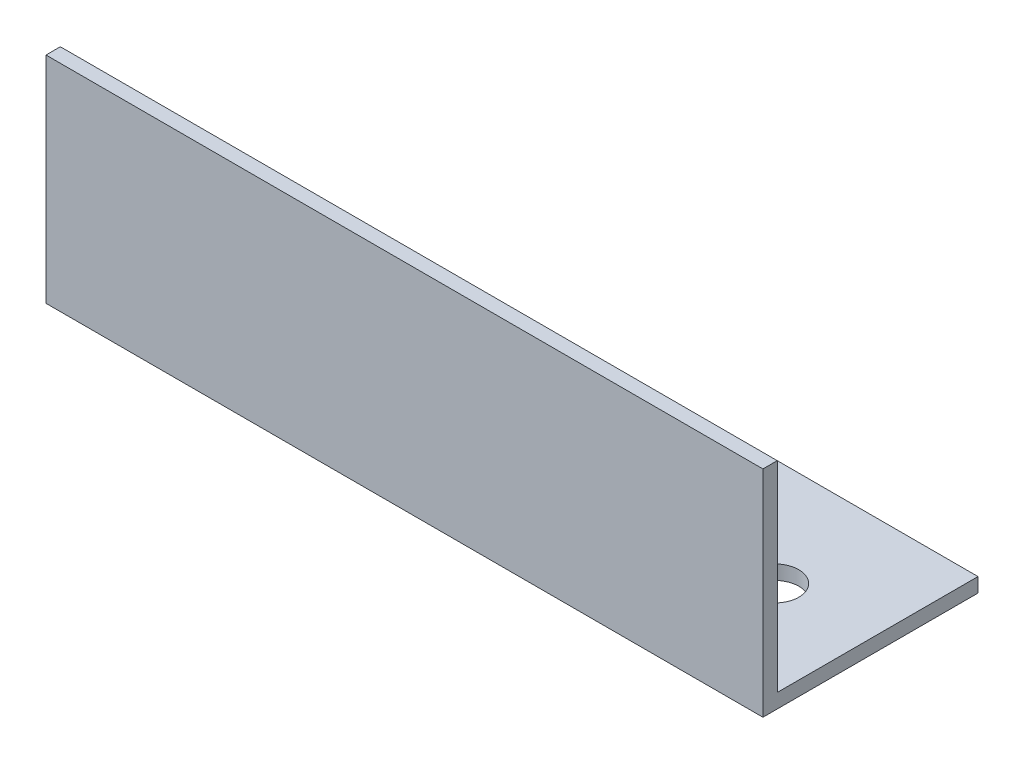
ISO-10303-21;
HEADER;
FILE_DESCRIPTION(('STEP AP214'),'2;1');
FILE_NAME('part.step','',(''),(''),'','','');
FILE_SCHEMA(('AUTOMOTIVE_DESIGN { 1 0 10303 214 1 1 1 1 }'));
ENDSEC;
DATA;
#1=APPLICATION_CONTEXT('core data for automotive mechanical design processes');
#2=APPLICATION_PROTOCOL_DEFINITION('international standard','automotive_design',2000,#1);
#3=PRODUCT_CONTEXT('',#1,'mechanical');
#4=PRODUCT('Part','Part','',(#3));
#5=PRODUCT_RELATED_PRODUCT_CATEGORY('part','',(#4));
#6=PRODUCT_DEFINITION_FORMATION('','',#4);
#7=PRODUCT_DEFINITION_CONTEXT('part definition',#1,'design');
#8=PRODUCT_DEFINITION('design','',#6,#7);
#9=PRODUCT_DEFINITION_SHAPE('','',#8);
#10=(LENGTH_UNIT() NAMED_UNIT(*) SI_UNIT(.MILLI.,.METRE.));
#11=(NAMED_UNIT(*) PLANE_ANGLE_UNIT() SI_UNIT($,.RADIAN.));
#12=(NAMED_UNIT(*) SI_UNIT($,.STERADIAN.) SOLID_ANGLE_UNIT());
#13=UNCERTAINTY_MEASURE_WITH_UNIT(LENGTH_MEASURE(1.E-05),#10,'distance_accuracy_value','');
#14=(GEOMETRIC_REPRESENTATION_CONTEXT(3) GLOBAL_UNCERTAINTY_ASSIGNED_CONTEXT((#13)) GLOBAL_UNIT_ASSIGNED_CONTEXT((#10,
#11,#12)) REPRESENTATION_CONTEXT('',''));
#15=CARTESIAN_POINT('',(0.,0.,0.));
#16=DIRECTION('',(0.,0.,1.));
#17=DIRECTION('',(1.,0.,0.));
#18=AXIS2_PLACEMENT_3D('',#15,#16,#17);
#19=CARTESIAN_POINT('',(150.,0.,0.));
#20=DIRECTION('',(0.,1.,0.));
#21=DIRECTION('',(0.,0.,1.));
#22=AXIS2_PLACEMENT_3D('',#19,#20,#21);
#23=PLANE('',#22);
#24=CARTESIAN_POINT('',(30.,0.,-22.5));
#25=DIRECTION('',(0.,-1.,0.));
#26=DIRECTION('',(0.,0.,-1.));
#27=AXIS2_PLACEMENT_3D('',#24,#25,#26);
#28=CIRCLE('',#27,5.);
#29=CARTESIAN_POINT('',(30.,0.,-27.5));
#30=VERTEX_POINT('',#29);
#31=EDGE_CURVE('E135',#30,#30,#28,.T.);
#32=ORIENTED_EDGE('',*,*,#31,.F.);
#33=EDGE_LOOP('',(#32));
#34=FACE_BOUND('',#33,.T.);
#35=CARTESIAN_POINT('',(130.,0.,-22.5));
#36=DIRECTION('',(0.,-1.,0.));
#37=DIRECTION('',(0.,0.,-1.));
#38=AXIS2_PLACEMENT_3D('',#35,#36,#37);
#39=CIRCLE('',#38,4.99999999999999);
#40=CARTESIAN_POINT('',(130.,0.,-27.5));
#41=VERTEX_POINT('',#40);
#42=EDGE_CURVE('E140',#41,#41,#39,.T.);
#43=ORIENTED_EDGE('',*,*,#42,.F.);
#44=EDGE_LOOP('',(#43));
#45=FACE_BOUND('',#44,.T.);
#46=DIRECTION('',(0.,0.,-1.));
#47=VECTOR('',#46,1.);
#48=CARTESIAN_POINT('',(0.,0.,0.));
#49=LINE('',#48,#47);
#50=CARTESIAN_POINT('',(0.,0.,0.));
#51=VERTEX_POINT('',#50);
#52=CARTESIAN_POINT('',(0.,0.,-45.));
#53=VERTEX_POINT('',#52);
#54=EDGE_CURVE('E117',#51,#53,#49,.T.);
#55=ORIENTED_EDGE('',*,*,#54,.T.);
#56=DIRECTION('',(-1.,0.,0.));
#57=VECTOR('',#56,1.);
#58=CARTESIAN_POINT('',(150.,0.,-45.));
#59=LINE('',#58,#57);
#60=CARTESIAN_POINT('',(150.,0.,-45.));
#61=VERTEX_POINT('',#60);
#62=EDGE_CURVE('E11',#61,#53,#59,.T.);
#63=ORIENTED_EDGE('',*,*,#62,.F.);
#64=DIRECTION('',(0.,0.,-1.));
#65=VECTOR('',#64,1.);
#66=CARTESIAN_POINT('',(150.,0.,0.));
#67=LINE('',#66,#65);
#68=CARTESIAN_POINT('',(150.,0.,0.));
#69=VERTEX_POINT('',#68);
#70=EDGE_CURVE('E82',#69,#61,#67,.T.);
#71=ORIENTED_EDGE('',*,*,#70,.F.);
#72=DIRECTION('',(-1.,0.,0.));
#73=VECTOR('',#72,1.);
#74=CARTESIAN_POINT('',(150.,0.,0.));
#75=LINE('',#74,#73);
#76=EDGE_CURVE('E113',#69,#51,#75,.T.);
#77=ORIENTED_EDGE('',*,*,#76,.T.);
#78=EDGE_LOOP('',(#55,#63,#71,#77));
#79=FACE_BOUND('',#78,.T.);
#80=ADVANCED_FACE('F34',(#34,#45,#79),#23,.F.);
#81=CARTESIAN_POINT('',(150.,3.,-45.));
#82=DIRECTION('',(0.,0.,-1.));
#83=DIRECTION('',(-1.,0.,0.));
#84=AXIS2_PLACEMENT_3D('',#81,#82,#83);
#85=PLANE('',#84);
#86=DIRECTION('',(0.,-1.,0.));
#87=VECTOR('',#86,1.);
#88=CARTESIAN_POINT('',(0.,3.,-45.));
#89=LINE('',#88,#87);
#90=CARTESIAN_POINT('',(0.,3.,-45.));
#91=VERTEX_POINT('',#90);
#92=EDGE_CURVE('E120',#91,#53,#89,.T.);
#93=ORIENTED_EDGE('',*,*,#92,.F.);
#94=DIRECTION('',(-1.,0.,0.));
#95=VECTOR('',#94,1.);
#96=CARTESIAN_POINT('',(150.,3.,-45.));
#97=LINE('',#96,#95);
#98=CARTESIAN_POINT('',(150.,3.,-45.));
#99=VERTEX_POINT('',#98);
#100=EDGE_CURVE('E43',#99,#91,#97,.T.);
#101=ORIENTED_EDGE('',*,*,#100,.F.);
#102=DIRECTION('',(0.,-1.,0.));
#103=VECTOR('',#102,1.);
#104=CARTESIAN_POINT('',(150.,3.,-45.));
#105=LINE('',#104,#103);
#106=EDGE_CURVE('E148',#99,#61,#105,.T.);
#107=ORIENTED_EDGE('',*,*,#106,.T.);
#108=ORIENTED_EDGE('',*,*,#62,.T.);
#109=EDGE_LOOP('',(#93,#101,#107,#108));
#110=FACE_BOUND('',#109,.T.);
#111=ADVANCED_FACE('F169',(#110),#85,.T.);
#112=CARTESIAN_POINT('',(150.,3.,0.));
#113=DIRECTION('',(0.,1.,0.));
#114=DIRECTION('',(0.,0.,1.));
#115=AXIS2_PLACEMENT_3D('',#112,#113,#114);
#116=PLANE('',#115);
#117=CARTESIAN_POINT('',(30.,3.,-22.5));
#118=DIRECTION('',(0.,1.,0.));
#119=DIRECTION('',(0.,0.,1.));
#120=AXIS2_PLACEMENT_3D('',#117,#118,#119);
#121=CIRCLE('',#120,5.);
#122=CARTESIAN_POINT('',(30.,3.,-17.5));
#123=VERTEX_POINT('',#122);
#124=EDGE_CURVE('E37',#123,#123,#121,.T.);
#125=ORIENTED_EDGE('',*,*,#124,.F.);
#126=EDGE_LOOP('',(#125));
#127=FACE_BOUND('',#126,.T.);
#128=CARTESIAN_POINT('',(130.,3.,-22.5));
#129=DIRECTION('',(0.,1.,0.));
#130=DIRECTION('',(0.,0.,1.));
#131=AXIS2_PLACEMENT_3D('',#128,#129,#130);
#132=CIRCLE('',#131,4.99999999999999);
#133=CARTESIAN_POINT('',(130.,3.,-17.5));
#134=VERTEX_POINT('',#133);
#135=EDGE_CURVE('E133',#134,#134,#132,.T.);
#136=ORIENTED_EDGE('',*,*,#135,.F.);
#137=EDGE_LOOP('',(#136));
#138=FACE_BOUND('',#137,.T.);
#139=DIRECTION('',(0.,0.,-1.));
#140=VECTOR('',#139,1.);
#141=CARTESIAN_POINT('',(0.,3.,0.));
#142=LINE('',#141,#140);
#143=CARTESIAN_POINT('',(0.,3.,-3.));
#144=VERTEX_POINT('',#143);
#145=EDGE_CURVE('E123',#144,#91,#142,.T.);
#146=ORIENTED_EDGE('',*,*,#145,.F.);
#147=DIRECTION('',(-1.,0.,0.));
#148=VECTOR('',#147,1.);
#149=CARTESIAN_POINT('',(150.,3.,-3.));
#150=LINE('',#149,#148);
#151=CARTESIAN_POINT('',(150.,3.,-3.));
#152=VERTEX_POINT('',#151);
#153=EDGE_CURVE('E103',#152,#144,#150,.T.);
#154=ORIENTED_EDGE('',*,*,#153,.F.);
#155=DIRECTION('',(0.,0.,-1.));
#156=VECTOR('',#155,1.);
#157=CARTESIAN_POINT('',(150.,3.,0.));
#158=LINE('',#157,#156);
#159=EDGE_CURVE('E109',#152,#99,#158,.T.);
#160=ORIENTED_EDGE('',*,*,#159,.T.);
#161=ORIENTED_EDGE('',*,*,#100,.T.);
#162=EDGE_LOOP('',(#146,#154,#160,#161));
#163=FACE_BOUND('',#162,.T.);
#164=ADVANCED_FACE('F152',(#127,#138,#163),#116,.T.);
#165=CARTESIAN_POINT('',(150.,0.,-3.));
#166=DIRECTION('',(0.,0.,-1.));
#167=DIRECTION('',(-1.,0.,0.));
#168=AXIS2_PLACEMENT_3D('',#165,#166,#167);
#169=PLANE('',#168);
#170=DIRECTION('',(0.,1.,0.));
#171=VECTOR('',#170,1.);
#172=CARTESIAN_POINT('',(0.,0.,-3.));
#173=LINE('',#172,#171);
#174=CARTESIAN_POINT('',(0.,45.,-3.));
#175=VERTEX_POINT('',#174);
#176=EDGE_CURVE('E98',#175,#144,#173,.F.);
#177=ORIENTED_EDGE('',*,*,#176,.F.);
#178=DIRECTION('',(-1.,0.,0.));
#179=VECTOR('',#178,1.);
#180=CARTESIAN_POINT('',(150.,45.,-3.));
#181=LINE('',#180,#179);
#182=CARTESIAN_POINT('',(150.,45.,-3.));
#183=VERTEX_POINT('',#182);
#184=EDGE_CURVE('E93',#183,#175,#181,.T.);
#185=ORIENTED_EDGE('',*,*,#184,.F.);
#186=DIRECTION('',(0.,1.,0.));
#187=VECTOR('',#186,1.);
#188=CARTESIAN_POINT('',(150.,0.,-3.));
#189=LINE('',#188,#187);
#190=EDGE_CURVE('E96',#183,#152,#189,.F.);
#191=ORIENTED_EDGE('',*,*,#190,.T.);
#192=ORIENTED_EDGE('',*,*,#153,.T.);
#193=EDGE_LOOP('',(#177,#185,#191,#192));
#194=FACE_BOUND('',#193,.T.);
#195=ADVANCED_FACE('F95',(#194),#169,.T.);
#196=CARTESIAN_POINT('',(150.,45.,0.));
#197=DIRECTION('',(0.,1.,0.));
#198=DIRECTION('',(0.,0.,1.));
#199=AXIS2_PLACEMENT_3D('',#196,#197,#198);
#200=PLANE('',#199);
#201=DIRECTION('',(0.,0.,-1.));
#202=VECTOR('',#201,1.);
#203=CARTESIAN_POINT('',(0.,45.,0.));
#204=LINE('',#203,#202);
#205=CARTESIAN_POINT('',(0.,45.,0.));
#206=VERTEX_POINT('',#205);
#207=EDGE_CURVE('E127',#206,#175,#204,.T.);
#208=ORIENTED_EDGE('',*,*,#207,.F.);
#209=DIRECTION('',(-1.,0.,0.));
#210=VECTOR('',#209,1.);
#211=CARTESIAN_POINT('',(150.,45.,0.));
#212=LINE('',#211,#210);
#213=CARTESIAN_POINT('',(150.,45.,0.));
#214=VERTEX_POINT('',#213);
#215=EDGE_CURVE('E73',#214,#206,#212,.T.);
#216=ORIENTED_EDGE('',*,*,#215,.F.);
#217=DIRECTION('',(0.,0.,-1.));
#218=VECTOR('',#217,1.);
#219=CARTESIAN_POINT('',(150.,45.,0.));
#220=LINE('',#219,#218);
#221=EDGE_CURVE('E107',#214,#183,#220,.T.);
#222=ORIENTED_EDGE('',*,*,#221,.T.);
#223=ORIENTED_EDGE('',*,*,#184,.T.);
#224=EDGE_LOOP('',(#208,#216,#222,#223));
#225=FACE_BOUND('',#224,.T.);
#226=ADVANCED_FACE('F111',(#225),#200,.T.);
#227=CARTESIAN_POINT('',(150.,0.,0.));
#228=DIRECTION('',(0.,0.,-1.));
#229=DIRECTION('',(-1.,0.,0.));
#230=AXIS2_PLACEMENT_3D('',#227,#228,#229);
#231=PLANE('',#230);
#232=DIRECTION('',(0.,-1.,0.));
#233=VECTOR('',#232,1.);
#234=CARTESIAN_POINT('',(0.,0.,0.));
#235=LINE('',#234,#233);
#236=EDGE_CURVE('E76',#206,#51,#235,.T.);
#237=ORIENTED_EDGE('',*,*,#236,.T.);
#238=ORIENTED_EDGE('',*,*,#76,.F.);
#239=DIRECTION('',(0.,-1.,0.));
#240=VECTOR('',#239,1.);
#241=CARTESIAN_POINT('',(150.,0.,0.));
#242=LINE('',#241,#240);
#243=EDGE_CURVE('E52',#214,#69,#242,.T.);
#244=ORIENTED_EDGE('',*,*,#243,.F.);
#245=ORIENTED_EDGE('',*,*,#215,.T.);
#246=EDGE_LOOP('',(#237,#238,#244,#245));
#247=FACE_BOUND('',#246,.T.);
#248=ADVANCED_FACE('F158',(#247),#231,.F.);
#249=CARTESIAN_POINT('',(150.,0.,0.));
#250=DIRECTION('',(-1.,0.,0.));
#251=DIRECTION('',(0.,0.,1.));
#252=AXIS2_PLACEMENT_3D('',#249,#250,#251);
#253=PLANE('',#252);
#254=ORIENTED_EDGE('',*,*,#70,.T.);
#255=ORIENTED_EDGE('',*,*,#106,.F.);
#256=ORIENTED_EDGE('',*,*,#159,.F.);
#257=ORIENTED_EDGE('',*,*,#190,.F.);
#258=ORIENTED_EDGE('',*,*,#221,.F.);
#259=ORIENTED_EDGE('',*,*,#243,.T.);
#260=EDGE_LOOP('',(#254,#255,#256,#257,#258,#259));
#261=FACE_BOUND('',#260,.T.);
#262=ADVANCED_FACE('F106',(#261),#253,.F.);
#263=CARTESIAN_POINT('',(0.,0.,0.));
#264=DIRECTION('',(-1.,0.,0.));
#265=DIRECTION('',(0.,0.,1.));
#266=AXIS2_PLACEMENT_3D('',#263,#264,#265);
#267=PLANE('',#266);
#268=ORIENTED_EDGE('',*,*,#54,.F.);
#269=ORIENTED_EDGE('',*,*,#236,.F.);
#270=ORIENTED_EDGE('',*,*,#207,.T.);
#271=ORIENTED_EDGE('',*,*,#176,.T.);
#272=ORIENTED_EDGE('',*,*,#145,.T.);
#273=ORIENTED_EDGE('',*,*,#92,.T.);
#274=EDGE_LOOP('',(#268,#269,#270,#271,#272,#273));
#275=FACE_BOUND('',#274,.T.);
#276=ADVANCED_FACE('F156',(#275),#267,.T.);
#277=CARTESIAN_POINT('',(130.,45.,-22.5));
#278=DIRECTION('',(0.,-1.,0.));
#279=DIRECTION('',(0.,0.,-1.));
#280=AXIS2_PLACEMENT_3D('',#277,#278,#279);
#281=CYLINDRICAL_SURFACE('',#280,4.99999999999999);
#282=ORIENTED_EDGE('',*,*,#135,.T.);
#283=EDGE_LOOP('',(#282));
#284=FACE_BOUND('',#283,.T.);
#285=ORIENTED_EDGE('',*,*,#42,.T.);
#286=EDGE_LOOP('',(#285));
#287=FACE_BOUND('',#286,.T.);
#288=ADVANCED_FACE('F178',(#284,#287),#281,.F.);
#289=CARTESIAN_POINT('',(30.,45.,-22.5));
#290=DIRECTION('',(0.,-1.,0.));
#291=DIRECTION('',(0.,0.,-1.));
#292=AXIS2_PLACEMENT_3D('',#289,#290,#291);
#293=CYLINDRICAL_SURFACE('',#292,5.);
#294=ORIENTED_EDGE('',*,*,#124,.T.);
#295=EDGE_LOOP('',(#294));
#296=FACE_BOUND('',#295,.T.);
#297=ORIENTED_EDGE('',*,*,#31,.T.);
#298=EDGE_LOOP('',(#297));
#299=FACE_BOUND('',#298,.T.);
#300=ADVANCED_FACE('F180',(#296,#299),#293,.F.);
#301=CLOSED_SHELL('',(#80,#111,#164,#195,#226,#248,#262,#276,#288,#300));
#302=MANIFOLD_SOLID_BREP('B2',#301);
#303=ADVANCED_BREP_SHAPE_REPRESENTATION('',(#18,#302),#14);
#304=SHAPE_DEFINITION_REPRESENTATION(#9,#303);
ENDSEC;
END-ISO-10303-21;
